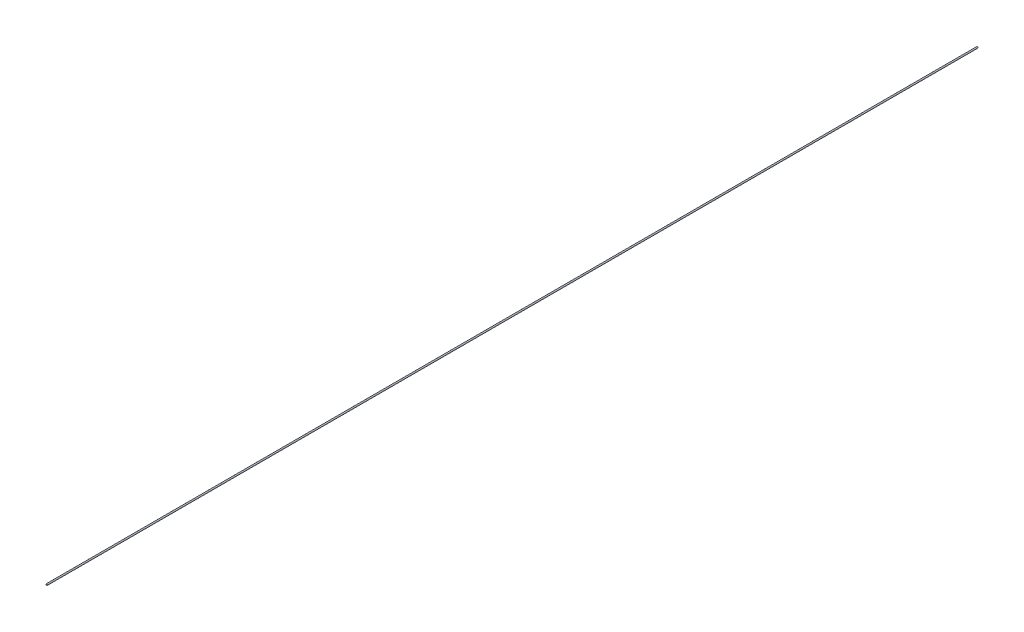
ISO-10303-21;
HEADER;
FILE_DESCRIPTION(('STEP AP214'),'2;1');
FILE_NAME('part.step','',(''),(''),'','','');
FILE_SCHEMA(('AUTOMOTIVE_DESIGN { 1 0 10303 214 1 1 1 1 }'));
ENDSEC;
DATA;
#1=APPLICATION_CONTEXT('core data for automotive mechanical design processes');
#2=APPLICATION_PROTOCOL_DEFINITION('international standard','automotive_design',2000,#1);
#3=PRODUCT_CONTEXT('',#1,'mechanical');
#4=PRODUCT('Part','Part','',(#3));
#5=PRODUCT_RELATED_PRODUCT_CATEGORY('part','',(#4));
#6=PRODUCT_DEFINITION_FORMATION('','',#4);
#7=PRODUCT_DEFINITION_CONTEXT('part definition',#1,'design');
#8=PRODUCT_DEFINITION('design','',#6,#7);
#9=PRODUCT_DEFINITION_SHAPE('','',#8);
#10=(LENGTH_UNIT() NAMED_UNIT(*) SI_UNIT(.MILLI.,.METRE.));
#11=(NAMED_UNIT(*) PLANE_ANGLE_UNIT() SI_UNIT($,.RADIAN.));
#12=(NAMED_UNIT(*) SI_UNIT($,.STERADIAN.) SOLID_ANGLE_UNIT());
#13=UNCERTAINTY_MEASURE_WITH_UNIT(LENGTH_MEASURE(1.E-05),#10,'distance_accuracy_value','');
#14=(GEOMETRIC_REPRESENTATION_CONTEXT(3) GLOBAL_UNCERTAINTY_ASSIGNED_CONTEXT((#13)) GLOBAL_UNIT_ASSIGNED_CONTEXT((#10,
#11,#12)) REPRESENTATION_CONTEXT('',''));
#15=CARTESIAN_POINT('',(0.,0.,0.));
#16=DIRECTION('',(0.,0.,1.));
#17=DIRECTION('',(1.,0.,0.));
#18=AXIS2_PLACEMENT_3D('',#15,#16,#17);
#19=CARTESIAN_POINT('',(-304.50495596462,-230.17386259315,1357.00000000001));
#20=DIRECTION('',(0.,0.,-1.));
#21=DIRECTION('',(-1.,0.,0.));
#22=AXIS2_PLACEMENT_3D('',#19,#20,#21);
#23=CYLINDRICAL_SURFACE('',#22,1.00000000000006);
#24=CARTESIAN_POINT('',(-304.50495596462,-230.17386259315,1357.00000000001));
#25=DIRECTION('',(0.,0.,1.));
#26=DIRECTION('',(1.,0.,0.));
#27=AXIS2_PLACEMENT_3D('',#24,#25,#26);
#28=CIRCLE('',#27,1.00000000000006);
#29=CARTESIAN_POINT('',(-303.50495596462,-230.17386259315,1357.00000000001));
#30=VERTEX_POINT('',#29);
#31=EDGE_CURVE('E10',#30,#30,#28,.T.);
#32=ORIENTED_EDGE('',*,*,#31,.F.);
#33=EDGE_LOOP('',(#32));
#34=FACE_BOUND('',#33,.T.);
#35=CARTESIAN_POINT('',(-304.50495596462,-230.17386259315,0.));
#36=DIRECTION('',(0.,0.,1.));
#37=DIRECTION('',(1.,0.,0.));
#38=AXIS2_PLACEMENT_3D('',#35,#36,#37);
#39=CIRCLE('',#38,1.00000000000006);
#40=CARTESIAN_POINT('',(-303.50495596462,-230.17386259315,0.));
#41=VERTEX_POINT('',#40);
#42=EDGE_CURVE('E36',#41,#41,#39,.T.);
#43=ORIENTED_EDGE('',*,*,#42,.T.);
#44=EDGE_LOOP('',(#43));
#45=FACE_BOUND('',#44,.T.);
#46=ADVANCED_FACE('F33',(#34,#45),#23,.T.);
#47=CARTESIAN_POINT('',(-304.50495596462,-230.17386259315,1357.00000000001));
#48=DIRECTION('',(0.,0.,1.));
#49=DIRECTION('',(1.,0.,0.));
#50=AXIS2_PLACEMENT_3D('',#47,#48,#49);
#51=PLANE('',#50);
#52=ORIENTED_EDGE('',*,*,#31,.T.);
#53=EDGE_LOOP('',(#52));
#54=FACE_BOUND('',#53,.T.);
#55=ADVANCED_FACE('F48',(#54),#51,.T.);
#56=CARTESIAN_POINT('',(-304.50495596462,-230.17386259315,0.));
#57=DIRECTION('',(0.,0.,1.));
#58=DIRECTION('',(1.,0.,0.));
#59=AXIS2_PLACEMENT_3D('',#56,#57,#58);
#60=PLANE('',#59);
#61=ORIENTED_EDGE('',*,*,#42,.F.);
#62=EDGE_LOOP('',(#61));
#63=FACE_BOUND('',#62,.T.);
#64=ADVANCED_FACE('F46',(#63),#60,.F.);
#65=CLOSED_SHELL('',(#46,#55,#64));
#66=MANIFOLD_SOLID_BREP('B2',#65);
#67=ADVANCED_BREP_SHAPE_REPRESENTATION('',(#18,#66),#14);
#68=SHAPE_DEFINITION_REPRESENTATION(#9,#67);
ENDSEC;
END-ISO-10303-21;
